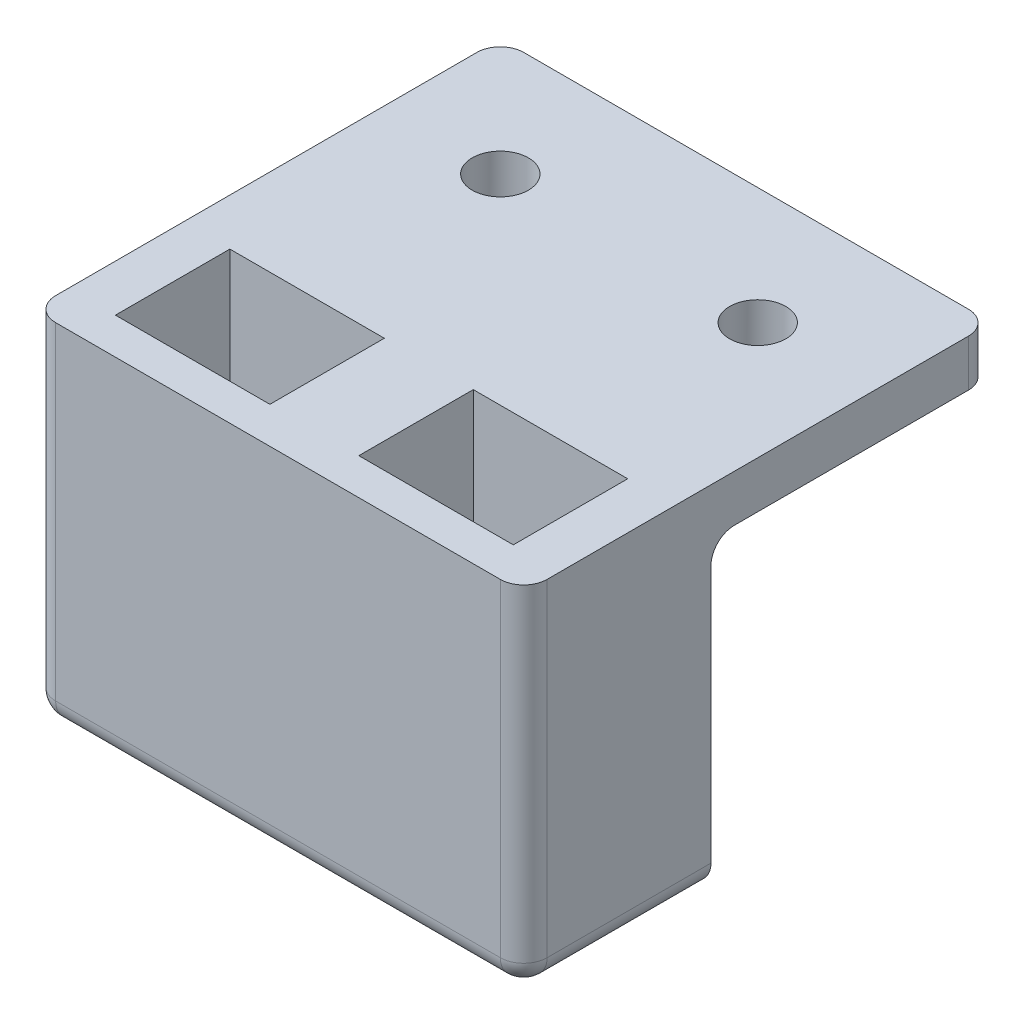
ISO-10303-21;
HEADER;
FILE_DESCRIPTION(('STEP AP214'),'2;1');
FILE_NAME('part.step','',(''),(''),'','','');
FILE_SCHEMA(('AUTOMOTIVE_DESIGN { 1 0 10303 214 1 1 1 1 }'));
ENDSEC;
DATA;
#1=APPLICATION_CONTEXT('core data for automotive mechanical design processes');
#2=APPLICATION_PROTOCOL_DEFINITION('international standard','automotive_design',2000,#1);
#3=PRODUCT_CONTEXT('',#1,'mechanical');
#4=PRODUCT('Part','Part','',(#3));
#5=PRODUCT_RELATED_PRODUCT_CATEGORY('part','',(#4));
#6=PRODUCT_DEFINITION_FORMATION('','',#4);
#7=PRODUCT_DEFINITION_CONTEXT('part definition',#1,'design');
#8=PRODUCT_DEFINITION('design','',#6,#7);
#9=PRODUCT_DEFINITION_SHAPE('','',#8);
#10=(LENGTH_UNIT() NAMED_UNIT(*) SI_UNIT(.MILLI.,.METRE.));
#11=(NAMED_UNIT(*) PLANE_ANGLE_UNIT() SI_UNIT($,.RADIAN.));
#12=(NAMED_UNIT(*) SI_UNIT($,.STERADIAN.) SOLID_ANGLE_UNIT());
#13=UNCERTAINTY_MEASURE_WITH_UNIT(LENGTH_MEASURE(1.E-05),#10,'distance_accuracy_value','');
#14=(GEOMETRIC_REPRESENTATION_CONTEXT(3) GLOBAL_UNCERTAINTY_ASSIGNED_CONTEXT((#13)) GLOBAL_UNIT_ASSIGNED_CONTEXT((#10,
#11,#12)) REPRESENTATION_CONTEXT('',''));
#15=CARTESIAN_POINT('',(0.,0.,0.));
#16=DIRECTION('',(0.,0.,1.));
#17=DIRECTION('',(1.,0.,0.));
#18=AXIS2_PLACEMENT_3D('',#15,#16,#17);
#19=CARTESIAN_POINT('',(0.,15.,0.));
#20=DIRECTION('',(0.,-1.,0.));
#21=DIRECTION('',(0.,0.,-1.));
#22=AXIS2_PLACEMENT_3D('',#19,#20,#21);
#23=PLANE('',#22);
#24=CARTESIAN_POINT('',(5.,15.,-15.));
#25=DIRECTION('',(0.,1.,0.));
#26=DIRECTION('',(0.,0.,1.));
#27=AXIS2_PLACEMENT_3D('',#24,#25,#26);
#28=CIRCLE('',#27,1.2);
#29=CARTESIAN_POINT('',(5.,15.,-13.8));
#30=VERTEX_POINT('',#29);
#31=EDGE_CURVE('E609',#30,#30,#28,.T.);
#32=ORIENTED_EDGE('',*,*,#31,.F.);
#33=EDGE_LOOP('',(#32));
#34=FACE_BOUND('',#33,.T.);
#35=DIRECTION('',(0.,0.,1.));
#36=VECTOR('',#35,1.);
#37=CARTESIAN_POINT('',(19.,15.,-1.555));
#38=LINE('',#37,#36);
#39=CARTESIAN_POINT('',(19.,15.,-6.445));
#40=VERTEX_POINT('',#39);
#41=CARTESIAN_POINT('',(19.,15.,-1.555));
#42=VERTEX_POINT('',#41);
#43=EDGE_CURVE('E274',#40,#42,#38,.T.);
#44=ORIENTED_EDGE('',*,*,#43,.T.);
#45=DIRECTION('',(-1.,0.,0.));
#46=VECTOR('',#45,1.);
#47=CARTESIAN_POINT('',(19.,15.,-1.555));
#48=LINE('',#47,#46);
#49=CARTESIAN_POINT('',(12.4,15.,-1.555));
#50=VERTEX_POINT('',#49);
#51=EDGE_CURVE('E261',#42,#50,#48,.T.);
#52=ORIENTED_EDGE('',*,*,#51,.T.);
#53=DIRECTION('',(0.,0.,-1.));
#54=VECTOR('',#53,1.);
#55=CARTESIAN_POINT('',(12.4,15.,-1.555));
#56=LINE('',#55,#54);
#57=CARTESIAN_POINT('',(12.4,15.,-6.445));
#58=VERTEX_POINT('',#57);
#59=EDGE_CURVE('E266',#50,#58,#56,.T.);
#60=ORIENTED_EDGE('',*,*,#59,.T.);
#61=DIRECTION('',(1.,0.,0.));
#62=VECTOR('',#61,1.);
#63=CARTESIAN_POINT('',(19.,15.,-6.445));
#64=LINE('',#63,#62);
#65=EDGE_CURVE('E270',#58,#40,#64,.T.);
#66=ORIENTED_EDGE('',*,*,#65,.T.);
#67=EDGE_LOOP('',(#44,#52,#60,#66));
#68=FACE_BOUND('',#67,.T.);
#69=DIRECTION('',(0.,0.,-1.));
#70=VECTOR('',#69,1.);
#71=CARTESIAN_POINT('',(8.6,15.,-1.555));
#72=LINE('',#71,#70);
#73=CARTESIAN_POINT('',(8.6,15.,-1.555));
#74=VERTEX_POINT('',#73);
#75=CARTESIAN_POINT('',(8.6,15.,-6.445));
#76=VERTEX_POINT('',#75);
#77=EDGE_CURVE('E352',#74,#76,#72,.T.);
#78=ORIENTED_EDGE('',*,*,#77,.F.);
#79=DIRECTION('',(1.,0.,0.));
#80=VECTOR('',#79,1.);
#81=CARTESIAN_POINT('',(2.,15.,-1.555));
#82=LINE('',#81,#80);
#83=CARTESIAN_POINT('',(2.,15.,-1.555));
#84=VERTEX_POINT('',#83);
#85=EDGE_CURVE('E338',#84,#74,#82,.T.);
#86=ORIENTED_EDGE('',*,*,#85,.F.);
#87=DIRECTION('',(0.,0.,1.));
#88=VECTOR('',#87,1.);
#89=CARTESIAN_POINT('',(2.,15.,-1.555));
#90=LINE('',#89,#88);
#91=CARTESIAN_POINT('',(2.,15.,-6.445));
#92=VERTEX_POINT('',#91);
#93=EDGE_CURVE('E333',#92,#84,#90,.T.);
#94=ORIENTED_EDGE('',*,*,#93,.F.);
#95=DIRECTION('',(-1.,0.,0.));
#96=VECTOR('',#95,1.);
#97=CARTESIAN_POINT('',(2.,15.,-6.445));
#98=LINE('',#97,#96);
#99=EDGE_CURVE('E349',#76,#92,#98,.T.);
#100=ORIENTED_EDGE('',*,*,#99,.F.);
#101=EDGE_LOOP('',(#78,#86,#94,#100));
#102=FACE_BOUND('',#101,.T.);
#103=DIRECTION('',(1.,0.,0.));
#104=VECTOR('',#103,1.);
#105=CARTESIAN_POINT('',(21.,15.,-20.));
#106=LINE('',#105,#104);
#107=CARTESIAN_POINT('',(1.00000000000001,15.,-20.));
#108=VERTEX_POINT('',#107);
#109=CARTESIAN_POINT('',(20.,15.,-20.));
#110=VERTEX_POINT('',#109);
#111=EDGE_CURVE('E427',#108,#110,#106,.T.);
#112=ORIENTED_EDGE('',*,*,#111,.F.);
#113=CARTESIAN_POINT('',(1.,15.,-19.));
#114=DIRECTION('',(0.,-1.,0.));
#115=DIRECTION('',(0.,0.,-1.));
#116=AXIS2_PLACEMENT_3D('',#113,#114,#115);
#117=CIRCLE('',#116,1.);
#118=CARTESIAN_POINT('',(0.,15.,-19.));
#119=VERTEX_POINT('',#118);
#120=EDGE_CURVE('E60',#108,#119,#117,.F.);
#121=ORIENTED_EDGE('',*,*,#120,.T.);
#122=DIRECTION('',(0.,0.,1.));
#123=VECTOR('',#122,1.);
#124=CARTESIAN_POINT('',(0.,15.,0.));
#125=LINE('',#124,#123);
#126=CARTESIAN_POINT('',(0.,15.,-1.));
#127=VERTEX_POINT('',#126);
#128=EDGE_CURVE('E696',#119,#127,#125,.T.);
#129=ORIENTED_EDGE('',*,*,#128,.T.);
#130=CARTESIAN_POINT('',(1.,15.,-1.));
#131=DIRECTION('',(0.,-1.,0.));
#132=DIRECTION('',(0.,0.,-1.));
#133=AXIS2_PLACEMENT_3D('',#130,#131,#132);
#134=CIRCLE('',#133,1.);
#135=CARTESIAN_POINT('',(1.,15.,0.));
#136=VERTEX_POINT('',#135);
#137=EDGE_CURVE('E449',#127,#136,#134,.F.);
#138=ORIENTED_EDGE('',*,*,#137,.T.);
#139=DIRECTION('',(1.,0.,0.));
#140=VECTOR('',#139,1.);
#141=CARTESIAN_POINT('',(0.,15.,0.));
#142=LINE('',#141,#140);
#143=CARTESIAN_POINT('',(20.,15.,0.));
#144=VERTEX_POINT('',#143);
#145=EDGE_CURVE('E698',#136,#144,#142,.T.);
#146=ORIENTED_EDGE('',*,*,#145,.T.);
#147=CARTESIAN_POINT('',(20.,15.,-1.));
#148=DIRECTION('',(0.,-1.,0.));
#149=DIRECTION('',(0.,0.,-1.));
#150=AXIS2_PLACEMENT_3D('',#147,#148,#149);
#151=CIRCLE('',#150,1.);
#152=CARTESIAN_POINT('',(21.,15.,-1.));
#153=VERTEX_POINT('',#152);
#154=EDGE_CURVE('E451',#144,#153,#151,.F.);
#155=ORIENTED_EDGE('',*,*,#154,.T.);
#156=DIRECTION('',(0.,0.,-1.));
#157=VECTOR('',#156,1.);
#158=CARTESIAN_POINT('',(21.,15.,0.));
#159=LINE('',#158,#157);
#160=CARTESIAN_POINT('',(21.,15.,-19.));
#161=VERTEX_POINT('',#160);
#162=EDGE_CURVE('E380',#153,#161,#159,.T.);
#163=ORIENTED_EDGE('',*,*,#162,.T.);
#164=CARTESIAN_POINT('',(20.,15.,-19.));
#165=DIRECTION('',(0.,-1.,0.));
#166=DIRECTION('',(0.,0.,-1.));
#167=AXIS2_PLACEMENT_3D('',#164,#165,#166);
#168=CIRCLE('',#167,1.);
#169=EDGE_CURVE('E389',#161,#110,#168,.F.);
#170=ORIENTED_EDGE('',*,*,#169,.T.);
#171=EDGE_LOOP('',(#112,#121,#129,#138,#146,#155,#163,#170));
#172=FACE_BOUND('',#171,.T.);
#173=CARTESIAN_POINT('',(16.,15.,-15.));
#174=DIRECTION('',(0.,1.,0.));
#175=DIRECTION('',(0.,0.,1.));
#176=AXIS2_PLACEMENT_3D('',#173,#174,#175);
#177=CIRCLE('',#176,1.2);
#178=CARTESIAN_POINT('',(16.,15.,-13.8));
#179=VERTEX_POINT('',#178);
#180=EDGE_CURVE('E603',#179,#179,#177,.T.);
#181=ORIENTED_EDGE('',*,*,#180,.F.);
#182=EDGE_LOOP('',(#181));
#183=FACE_BOUND('',#182,.T.);
#184=ADVANCED_FACE('F37',(#34,#68,#102,#172,#183),#23,.F.);
#185=CARTESIAN_POINT('',(0.,15.,-8.));
#186=DIRECTION('',(0.,0.,1.));
#187=DIRECTION('',(1.,0.,0.));
#188=AXIS2_PLACEMENT_3D('',#185,#186,#187);
#189=PLANE('',#188);
#190=DIRECTION('',(0.,-1.,0.));
#191=VECTOR('',#190,1.);
#192=CARTESIAN_POINT('',(0.,15.,-8.));
#193=LINE('',#192,#191);
#194=CARTESIAN_POINT('',(0.,12.,-8.));
#195=VERTEX_POINT('',#194);
#196=CARTESIAN_POINT('',(0.,1.,-8.));
#197=VERTEX_POINT('',#196);
#198=EDGE_CURVE('E376',#195,#197,#193,.T.);
#199=ORIENTED_EDGE('',*,*,#198,.F.);
#200=DIRECTION('',(-1.,0.,0.));
#201=VECTOR('',#200,1.);
#202=CARTESIAN_POINT('',(21.,12.,-8.));
#203=LINE('',#202,#201);
#204=CARTESIAN_POINT('',(21.,12.,-8.));
#205=VERTEX_POINT('',#204);
#206=EDGE_CURVE('E381',#195,#205,#203,.F.);
#207=ORIENTED_EDGE('',*,*,#206,.T.);
#208=DIRECTION('',(0.,-1.,0.));
#209=VECTOR('',#208,1.);
#210=CARTESIAN_POINT('',(21.,15.,-8.));
#211=LINE('',#210,#209);
#212=CARTESIAN_POINT('',(21.,1.,-8.));
#213=VERTEX_POINT('',#212);
#214=EDGE_CURVE('E372',#205,#213,#211,.T.);
#215=ORIENTED_EDGE('',*,*,#214,.T.);
#216=CARTESIAN_POINT('',(20.,1.,-8.));
#217=DIRECTION('',(0.,0.,1.));
#218=DIRECTION('',(1.,0.,0.));
#219=AXIS2_PLACEMENT_3D('',#216,#217,#218);
#220=CIRCLE('',#219,1.);
#221=CARTESIAN_POINT('',(20.,0.,-8.));
#222=VERTEX_POINT('',#221);
#223=EDGE_CURVE('E464',#213,#222,#220,.F.);
#224=ORIENTED_EDGE('',*,*,#223,.T.);
#225=DIRECTION('',(-1.,0.,0.));
#226=VECTOR('',#225,1.);
#227=CARTESIAN_POINT('',(0.,0.,-8.));
#228=LINE('',#227,#226);
#229=CARTESIAN_POINT('',(1.,0.,-8.));
#230=VERTEX_POINT('',#229);
#231=EDGE_CURVE('E678',#222,#230,#228,.T.);
#232=ORIENTED_EDGE('',*,*,#231,.T.);
#233=CARTESIAN_POINT('',(1.,1.,-8.));
#234=DIRECTION('',(0.,0.,1.));
#235=DIRECTION('',(1.,0.,0.));
#236=AXIS2_PLACEMENT_3D('',#233,#234,#235);
#237=CIRCLE('',#236,1.);
#238=EDGE_CURVE('E411',#230,#197,#237,.F.);
#239=ORIENTED_EDGE('',*,*,#238,.T.);
#240=EDGE_LOOP('',(#199,#207,#215,#224,#232,#239));
#241=FACE_BOUND('',#240,.T.);
#242=ADVANCED_FACE('F407',(#241),#189,.F.);
#243=CARTESIAN_POINT('',(0.,3.,0.));
#244=DIRECTION('',(0.,-1.,0.));
#245=DIRECTION('',(0.,0.,-1.));
#246=AXIS2_PLACEMENT_3D('',#243,#244,#245);
#247=PLANE('',#246);
#248=DIRECTION('',(1.,0.,0.));
#249=VECTOR('',#248,1.);
#250=CARTESIAN_POINT('',(19.,3.,-6.445));
#251=LINE('',#250,#249);
#252=CARTESIAN_POINT('',(18.,3.,-6.445));
#253=VERTEX_POINT('',#252);
#254=CARTESIAN_POINT('',(19.,3.,-6.445));
#255=VERTEX_POINT('',#254);
#256=EDGE_CURVE('E273',#253,#255,#251,.T.);
#257=ORIENTED_EDGE('',*,*,#256,.F.);
#258=DIRECTION('',(0.,0.,1.));
#259=VECTOR('',#258,1.);
#260=CARTESIAN_POINT('',(18.,3.,-6.445));
#261=LINE('',#260,#259);
#262=CARTESIAN_POINT('',(18.,3.,-1.555));
#263=VERTEX_POINT('',#262);
#264=EDGE_CURVE('E241',#253,#263,#261,.T.);
#265=ORIENTED_EDGE('',*,*,#264,.T.);
#266=DIRECTION('',(-1.,0.,0.));
#267=VECTOR('',#266,1.);
#268=CARTESIAN_POINT('',(19.,3.,-1.555));
#269=LINE('',#268,#267);
#270=CARTESIAN_POINT('',(19.,3.,-1.555));
#271=VERTEX_POINT('',#270);
#272=EDGE_CURVE('E236',#271,#263,#269,.T.);
#273=ORIENTED_EDGE('',*,*,#272,.F.);
#274=DIRECTION('',(0.,0.,1.));
#275=VECTOR('',#274,1.);
#276=CARTESIAN_POINT('',(19.,3.,-1.555));
#277=LINE('',#276,#275);
#278=EDGE_CURVE('E283',#255,#271,#277,.T.);
#279=ORIENTED_EDGE('',*,*,#278,.F.);
#280=EDGE_LOOP('',(#257,#265,#273,#279));
#281=FACE_BOUND('',#280,.T.);
#282=ADVANCED_FACE('F521',(#281),#247,.F.);
#283=CARTESIAN_POINT('',(0.,0.,0.));
#284=DIRECTION('',(0.,-1.,0.));
#285=DIRECTION('',(0.,0.,-1.));
#286=AXIS2_PLACEMENT_3D('',#283,#284,#285);
#287=PLANE('',#286);
#288=DIRECTION('',(1.,0.,0.));
#289=VECTOR('',#288,1.);
#290=CARTESIAN_POINT('',(0.,0.,-1.));
#291=LINE('',#290,#289);
#292=CARTESIAN_POINT('',(20.,0.,-1.));
#293=VERTEX_POINT('',#292);
#294=CARTESIAN_POINT('',(1.,0.,-1.));
#295=VERTEX_POINT('',#294);
#296=EDGE_CURVE('E470',#293,#295,#291,.F.);
#297=ORIENTED_EDGE('',*,*,#296,.T.);
#298=DIRECTION('',(0.,0.,1.));
#299=VECTOR('',#298,1.);
#300=CARTESIAN_POINT('',(1.,0.,-8.));
#301=LINE('',#300,#299);
#302=EDGE_CURVE('E466',#295,#230,#301,.F.);
#303=ORIENTED_EDGE('',*,*,#302,.T.);
#304=ORIENTED_EDGE('',*,*,#231,.F.);
#305=DIRECTION('',(0.,0.,-1.));
#306=VECTOR('',#305,1.);
#307=CARTESIAN_POINT('',(20.,0.,0.));
#308=LINE('',#307,#306);
#309=EDGE_CURVE('E468',#222,#293,#308,.F.);
#310=ORIENTED_EDGE('',*,*,#309,.T.);
#311=EDGE_LOOP('',(#297,#303,#304,#310));
#312=FACE_BOUND('',#311,.T.);
#313=DIRECTION('',(1.,0.,0.));
#314=VECTOR('',#313,1.);
#315=CARTESIAN_POINT('',(3.,0.,-1.555));
#316=LINE('',#315,#314);
#317=CARTESIAN_POINT('',(3.,0.,-1.555));
#318=VERTEX_POINT('',#317);
#319=CARTESIAN_POINT('',(7.6,0.,-1.555));
#320=VERTEX_POINT('',#319);
#321=EDGE_CURVE('E311',#318,#320,#316,.T.);
#322=ORIENTED_EDGE('',*,*,#321,.T.);
#323=DIRECTION('',(0.,0.,-1.));
#324=VECTOR('',#323,1.);
#325=CARTESIAN_POINT('',(7.6,0.,-6.445));
#326=LINE('',#325,#324);
#327=CARTESIAN_POINT('',(7.6,0.,-6.445));
#328=VERTEX_POINT('',#327);
#329=EDGE_CURVE('E317',#320,#328,#326,.T.);
#330=ORIENTED_EDGE('',*,*,#329,.T.);
#331=DIRECTION('',(-1.,0.,0.));
#332=VECTOR('',#331,1.);
#333=CARTESIAN_POINT('',(3.,0.,-6.445));
#334=LINE('',#333,#332);
#335=CARTESIAN_POINT('',(3.,0.,-6.445));
#336=VERTEX_POINT('',#335);
#337=EDGE_CURVE('E322',#328,#336,#334,.T.);
#338=ORIENTED_EDGE('',*,*,#337,.T.);
#339=DIRECTION('',(0.,0.,1.));
#340=VECTOR('',#339,1.);
#341=CARTESIAN_POINT('',(3.,0.,-6.445));
#342=LINE('',#341,#340);
#343=EDGE_CURVE('E327',#336,#318,#342,.T.);
#344=ORIENTED_EDGE('',*,*,#343,.T.);
#345=EDGE_LOOP('',(#322,#330,#338,#344));
#346=FACE_BOUND('',#345,.T.);
#347=DIRECTION('',(-1.,0.,0.));
#348=VECTOR('',#347,1.);
#349=CARTESIAN_POINT('',(18.,0.,-1.555));
#350=LINE('',#349,#348);
#351=CARTESIAN_POINT('',(18.,0.,-1.555));
#352=VERTEX_POINT('',#351);
#353=CARTESIAN_POINT('',(13.4,0.,-1.555));
#354=VERTEX_POINT('',#353);
#355=EDGE_CURVE('E233',#352,#354,#350,.T.);
#356=ORIENTED_EDGE('',*,*,#355,.F.);
#357=DIRECTION('',(0.,0.,1.));
#358=VECTOR('',#357,1.);
#359=CARTESIAN_POINT('',(18.,0.,-6.445));
#360=LINE('',#359,#358);
#361=CARTESIAN_POINT('',(18.,0.,-6.445));
#362=VERTEX_POINT('',#361);
#363=EDGE_CURVE('E244',#362,#352,#360,.T.);
#364=ORIENTED_EDGE('',*,*,#363,.F.);
#365=DIRECTION('',(1.,0.,0.));
#366=VECTOR('',#365,1.);
#367=CARTESIAN_POINT('',(18.,0.,-6.445));
#368=LINE('',#367,#366);
#369=CARTESIAN_POINT('',(13.4,0.,-6.445));
#370=VERTEX_POINT('',#369);
#371=EDGE_CURVE('E250',#370,#362,#368,.T.);
#372=ORIENTED_EDGE('',*,*,#371,.F.);
#373=DIRECTION('',(0.,0.,-1.));
#374=VECTOR('',#373,1.);
#375=CARTESIAN_POINT('',(13.4,0.,-6.445));
#376=LINE('',#375,#374);
#377=EDGE_CURVE('E253',#354,#370,#376,.T.);
#378=ORIENTED_EDGE('',*,*,#377,.F.);
#379=EDGE_LOOP('',(#356,#364,#372,#378));
#380=FACE_BOUND('',#379,.T.);
#381=ADVANCED_FACE('F252',(#312,#346,#380),#287,.T.);
#382=CARTESIAN_POINT('',(0.,3.,0.));
#383=DIRECTION('',(0.,-1.,0.));
#384=DIRECTION('',(0.,0.,-1.));
#385=AXIS2_PLACEMENT_3D('',#382,#383,#384);
#386=PLANE('',#385);
#387=DIRECTION('',(0.,0.,1.));
#388=VECTOR('',#387,1.);
#389=CARTESIAN_POINT('',(3.,3.,-6.445));
#390=LINE('',#389,#388);
#391=CARTESIAN_POINT('',(3.,3.,-6.445));
#392=VERTEX_POINT('',#391);
#393=CARTESIAN_POINT('',(3.,3.,-1.555));
#394=VERTEX_POINT('',#393);
#395=EDGE_CURVE('E280',#392,#394,#390,.T.);
#396=ORIENTED_EDGE('',*,*,#395,.F.);
#397=DIRECTION('',(-1.,0.,0.));
#398=VECTOR('',#397,1.);
#399=CARTESIAN_POINT('',(2.,3.,-6.445));
#400=LINE('',#399,#398);
#401=CARTESIAN_POINT('',(2.,3.,-6.445));
#402=VERTEX_POINT('',#401);
#403=EDGE_CURVE('E312',#392,#402,#400,.T.);
#404=ORIENTED_EDGE('',*,*,#403,.T.);
#405=DIRECTION('',(0.,0.,1.));
#406=VECTOR('',#405,1.);
#407=CARTESIAN_POINT('',(2.,3.,-1.555));
#408=LINE('',#407,#406);
#409=CARTESIAN_POINT('',(2.,3.,-1.555));
#410=VERTEX_POINT('',#409);
#411=EDGE_CURVE('E359',#402,#410,#408,.T.);
#412=ORIENTED_EDGE('',*,*,#411,.T.);
#413=DIRECTION('',(1.,0.,0.));
#414=VECTOR('',#413,1.);
#415=CARTESIAN_POINT('',(2.,3.,-1.555));
#416=LINE('',#415,#414);
#417=EDGE_CURVE('E363',#410,#394,#416,.T.);
#418=ORIENTED_EDGE('',*,*,#417,.T.);
#419=EDGE_LOOP('',(#396,#404,#412,#418));
#420=FACE_BOUND('',#419,.T.);
#421=ADVANCED_FACE('F528',(#420),#386,.F.);
#422=DIRECTION('',(0.,0.,-1.));
#423=VECTOR('',#422,1.);
#424=CARTESIAN_POINT('',(7.6,3.,-6.445));
#425=LINE('',#424,#423);
#426=CARTESIAN_POINT('',(7.6,3.,-1.555));
#427=VERTEX_POINT('',#426);
#428=CARTESIAN_POINT('',(7.6,3.,-6.445));
#429=VERTEX_POINT('',#428);
#430=EDGE_CURVE('E307',#427,#429,#425,.T.);
#431=ORIENTED_EDGE('',*,*,#430,.F.);
#432=CARTESIAN_POINT('',(8.6,3.,-1.555));
#433=VERTEX_POINT('',#432);
#434=EDGE_CURVE('E351',#427,#433,#416,.T.);
#435=ORIENTED_EDGE('',*,*,#434,.T.);
#436=DIRECTION('',(0.,0.,-1.));
#437=VECTOR('',#436,1.);
#438=CARTESIAN_POINT('',(8.6,3.,-1.555));
#439=LINE('',#438,#437);
#440=CARTESIAN_POINT('',(8.6,3.,-6.445));
#441=VERTEX_POINT('',#440);
#442=EDGE_CURVE('E689',#433,#441,#439,.T.);
#443=ORIENTED_EDGE('',*,*,#442,.T.);
#444=EDGE_CURVE('E727',#441,#429,#400,.T.);
#445=ORIENTED_EDGE('',*,*,#444,.T.);
#446=EDGE_LOOP('',(#431,#435,#443,#445));
#447=FACE_BOUND('',#446,.T.);
#448=ADVANCED_FACE('F553',(#447),#386,.F.);
#449=CARTESIAN_POINT('',(0.,15.,0.));
#450=DIRECTION('',(1.,0.,0.));
#451=DIRECTION('',(0.,0.,-1.));
#452=AXIS2_PLACEMENT_3D('',#449,#450,#451);
#453=PLANE('',#452);
#454=ORIENTED_EDGE('',*,*,#128,.F.);
#455=DIRECTION('',(0.,1.,0.));
#456=VECTOR('',#455,1.);
#457=CARTESIAN_POINT('',(0.,13.,-19.));
#458=LINE('',#457,#456);
#459=CARTESIAN_POINT('',(0.,13.,-19.));
#460=VERTEX_POINT('',#459);
#461=EDGE_CURVE('E392',#119,#460,#458,.F.);
#462=ORIENTED_EDGE('',*,*,#461,.T.);
#463=DIRECTION('',(0.,0.,1.));
#464=VECTOR('',#463,1.);
#465=CARTESIAN_POINT('',(0.,13.,-20.));
#466=LINE('',#465,#464);
#467=CARTESIAN_POINT('',(0.,13.,-9.));
#468=VERTEX_POINT('',#467);
#469=EDGE_CURVE('E401',#460,#468,#466,.T.);
#470=ORIENTED_EDGE('',*,*,#469,.T.);
#471=CARTESIAN_POINT('',(0.,12.,-9.));
#472=DIRECTION('',(1.,0.,0.));
#473=DIRECTION('',(0.,0.,-1.));
#474=AXIS2_PLACEMENT_3D('',#471,#472,#473);
#475=CIRCLE('',#474,1.);
#476=EDGE_CURVE('E45',#468,#195,#475,.T.);
#477=ORIENTED_EDGE('',*,*,#476,.T.);
#478=ORIENTED_EDGE('',*,*,#198,.T.);
#479=DIRECTION('',(0.,0.,1.));
#480=VECTOR('',#479,1.);
#481=CARTESIAN_POINT('',(0.,1.,0.));
#482=LINE('',#481,#480);
#483=CARTESIAN_POINT('',(0.,1.,-1.));
#484=VERTEX_POINT('',#483);
#485=EDGE_CURVE('E472',#197,#484,#482,.T.);
#486=ORIENTED_EDGE('',*,*,#485,.T.);
#487=DIRECTION('',(0.,-1.,0.));
#488=VECTOR('',#487,1.);
#489=CARTESIAN_POINT('',(0.,15.,-1.));
#490=LINE('',#489,#488);
#491=EDGE_CURVE('E375',#484,#127,#490,.F.);
#492=ORIENTED_EDGE('',*,*,#491,.T.);
#493=EDGE_LOOP('',(#454,#462,#470,#477,#478,#486,#492));
#494=FACE_BOUND('',#493,.T.);
#495=ADVANCED_FACE('F397',(#494),#453,.F.);
#496=CARTESIAN_POINT('',(0.,15.,0.));
#497=DIRECTION('',(0.,0.,-1.));
#498=DIRECTION('',(-1.,0.,0.));
#499=AXIS2_PLACEMENT_3D('',#496,#497,#498);
#500=PLANE('',#499);
#501=ORIENTED_EDGE('',*,*,#145,.F.);
#502=DIRECTION('',(0.,-1.,0.));
#503=VECTOR('',#502,1.);
#504=CARTESIAN_POINT('',(1.,15.,0.));
#505=LINE('',#504,#503);
#506=CARTESIAN_POINT('',(1.,1.,0.));
#507=VERTEX_POINT('',#506);
#508=EDGE_CURVE('E453',#136,#507,#505,.T.);
#509=ORIENTED_EDGE('',*,*,#508,.T.);
#510=DIRECTION('',(1.,0.,0.));
#511=VECTOR('',#510,1.);
#512=CARTESIAN_POINT('',(21.,1.,0.));
#513=LINE('',#512,#511);
#514=CARTESIAN_POINT('',(20.,1.,0.));
#515=VERTEX_POINT('',#514);
#516=EDGE_CURVE('E455',#507,#515,#513,.T.);
#517=ORIENTED_EDGE('',*,*,#516,.T.);
#518=DIRECTION('',(0.,-1.,0.));
#519=VECTOR('',#518,1.);
#520=CARTESIAN_POINT('',(20.,15.,0.));
#521=LINE('',#520,#519);
#522=EDGE_CURVE('E457',#515,#144,#521,.F.);
#523=ORIENTED_EDGE('',*,*,#522,.T.);
#524=EDGE_LOOP('',(#501,#509,#517,#523));
#525=FACE_BOUND('',#524,.T.);
#526=ADVANCED_FACE('F547',(#525),#500,.F.);
#527=CARTESIAN_POINT('',(21.,15.,0.));
#528=DIRECTION('',(-1.,0.,0.));
#529=DIRECTION('',(0.,0.,1.));
#530=AXIS2_PLACEMENT_3D('',#527,#528,#529);
#531=PLANE('',#530);
#532=DIRECTION('',(0.,0.,1.));
#533=VECTOR('',#532,1.);
#534=CARTESIAN_POINT('',(21.,13.,-20.));
#535=LINE('',#534,#533);
#536=CARTESIAN_POINT('',(21.,13.,-19.));
#537=VERTEX_POINT('',#536);
#538=CARTESIAN_POINT('',(21.,13.,-9.));
#539=VERTEX_POINT('',#538);
#540=EDGE_CURVE('E417',#537,#539,#535,.T.);
#541=ORIENTED_EDGE('',*,*,#540,.F.);
#542=DIRECTION('',(0.,-1.,0.));
#543=VECTOR('',#542,1.);
#544=CARTESIAN_POINT('',(21.,15.,-19.));
#545=LINE('',#544,#543);
#546=EDGE_CURVE('E52',#537,#161,#545,.F.);
#547=ORIENTED_EDGE('',*,*,#546,.T.);
#548=ORIENTED_EDGE('',*,*,#162,.F.);
#549=DIRECTION('',(0.,-1.,0.));
#550=VECTOR('',#549,1.);
#551=CARTESIAN_POINT('',(21.,15.,-1.));
#552=LINE('',#551,#550);
#553=CARTESIAN_POINT('',(21.,1.,-1.));
#554=VERTEX_POINT('',#553);
#555=EDGE_CURVE('E461',#153,#554,#552,.T.);
#556=ORIENTED_EDGE('',*,*,#555,.T.);
#557=DIRECTION('',(0.,0.,-1.));
#558=VECTOR('',#557,1.);
#559=CARTESIAN_POINT('',(21.,1.,-8.));
#560=LINE('',#559,#558);
#561=EDGE_CURVE('E459',#554,#213,#560,.T.);
#562=ORIENTED_EDGE('',*,*,#561,.T.);
#563=ORIENTED_EDGE('',*,*,#214,.F.);
#564=CARTESIAN_POINT('',(21.,12.,-9.));
#565=DIRECTION('',(-1.,0.,0.));
#566=DIRECTION('',(0.,0.,1.));
#567=AXIS2_PLACEMENT_3D('',#564,#565,#566);
#568=CIRCLE('',#567,1.);
#569=EDGE_CURVE('E12',#205,#539,#568,.T.);
#570=ORIENTED_EDGE('',*,*,#569,.T.);
#571=EDGE_LOOP('',(#541,#547,#548,#556,#562,#563,#570));
#572=FACE_BOUND('',#571,.T.);
#573=ADVANCED_FACE('F416',(#572),#531,.F.);
#574=CARTESIAN_POINT('',(2.,-8.21414024715916,-1.555));
#575=DIRECTION('',(0.,0.,1.));
#576=DIRECTION('',(1.,0.,0.));
#577=AXIS2_PLACEMENT_3D('',#574,#575,#576);
#578=PLANE('',#577);
#579=DIRECTION('',(0.,1.,0.));
#580=VECTOR('',#579,1.);
#581=CARTESIAN_POINT('',(2.,-8.21414024715916,-1.555));
#582=LINE('',#581,#580);
#583=EDGE_CURVE('E672',#410,#84,#582,.T.);
#584=ORIENTED_EDGE('',*,*,#583,.T.);
#585=ORIENTED_EDGE('',*,*,#85,.T.);
#586=DIRECTION('',(0.,1.,0.));
#587=VECTOR('',#586,1.);
#588=CARTESIAN_POINT('',(8.6,-8.21414024715916,-1.555));
#589=LINE('',#588,#587);
#590=EDGE_CURVE('E366',#433,#74,#589,.T.);
#591=ORIENTED_EDGE('',*,*,#590,.F.);
#592=ORIENTED_EDGE('',*,*,#434,.F.);
#593=DIRECTION('',(0.,1.,0.));
#594=VECTOR('',#593,1.);
#595=CARTESIAN_POINT('',(7.6,-6.71357579833579,-1.555));
#596=LINE('',#595,#594);
#597=EDGE_CURVE('E315',#320,#427,#596,.T.);
#598=ORIENTED_EDGE('',*,*,#597,.F.);
#599=ORIENTED_EDGE('',*,*,#321,.F.);
#600=DIRECTION('',(0.,1.,0.));
#601=VECTOR('',#600,1.);
#602=CARTESIAN_POINT('',(3.,-6.71357579833579,-1.555));
#603=LINE('',#602,#601);
#604=EDGE_CURVE('E332',#318,#394,#603,.T.);
#605=ORIENTED_EDGE('',*,*,#604,.T.);
#606=ORIENTED_EDGE('',*,*,#417,.F.);
#607=EDGE_LOOP('',(#584,#585,#591,#592,#598,#599,#605,#606));
#608=FACE_BOUND('',#607,.T.);
#609=ADVANCED_FACE('F546',(#608),#578,.F.);
#610=CARTESIAN_POINT('',(8.6,-8.21414024715916,-1.555));
#611=DIRECTION('',(1.,0.,0.));
#612=DIRECTION('',(0.,0.,-1.));
#613=AXIS2_PLACEMENT_3D('',#610,#611,#612);
#614=PLANE('',#613);
#615=ORIENTED_EDGE('',*,*,#590,.T.);
#616=ORIENTED_EDGE('',*,*,#77,.T.);
#617=DIRECTION('',(0.,1.,0.));
#618=VECTOR('',#617,1.);
#619=CARTESIAN_POINT('',(8.6,-8.21414024715916,-6.445));
#620=LINE('',#619,#618);
#621=EDGE_CURVE('E687',#441,#76,#620,.T.);
#622=ORIENTED_EDGE('',*,*,#621,.F.);
#623=ORIENTED_EDGE('',*,*,#442,.F.);
#624=EDGE_LOOP('',(#615,#616,#622,#623));
#625=FACE_BOUND('',#624,.T.);
#626=ADVANCED_FACE('F664',(#625),#614,.F.);
#627=CARTESIAN_POINT('',(2.,-8.21414024715916,-6.445));
#628=DIRECTION('',(0.,0.,-1.));
#629=DIRECTION('',(-1.,0.,0.));
#630=AXIS2_PLACEMENT_3D('',#627,#628,#629);
#631=PLANE('',#630);
#632=ORIENTED_EDGE('',*,*,#621,.T.);
#633=ORIENTED_EDGE('',*,*,#99,.T.);
#634=DIRECTION('',(0.,1.,0.));
#635=VECTOR('',#634,1.);
#636=CARTESIAN_POINT('',(2.,-8.21414024715916,-6.445));
#637=LINE('',#636,#635);
#638=EDGE_CURVE('E683',#402,#92,#637,.T.);
#639=ORIENTED_EDGE('',*,*,#638,.F.);
#640=ORIENTED_EDGE('',*,*,#403,.F.);
#641=DIRECTION('',(0.,1.,0.));
#642=VECTOR('',#641,1.);
#643=CARTESIAN_POINT('',(3.,-6.71357579833579,-6.445));
#644=LINE('',#643,#642);
#645=EDGE_CURVE('E325',#336,#392,#644,.T.);
#646=ORIENTED_EDGE('',*,*,#645,.F.);
#647=ORIENTED_EDGE('',*,*,#337,.F.);
#648=DIRECTION('',(0.,1.,0.));
#649=VECTOR('',#648,1.);
#650=CARTESIAN_POINT('',(7.6,-6.71357579833579,-6.445));
#651=LINE('',#650,#649);
#652=EDGE_CURVE('E320',#328,#429,#651,.T.);
#653=ORIENTED_EDGE('',*,*,#652,.T.);
#654=ORIENTED_EDGE('',*,*,#444,.F.);
#655=EDGE_LOOP('',(#632,#633,#639,#640,#646,#647,#653,#654));
#656=FACE_BOUND('',#655,.T.);
#657=ADVANCED_FACE('F660',(#656),#631,.F.);
#658=CARTESIAN_POINT('',(2.,-8.21414024715916,-1.555));
#659=DIRECTION('',(-1.,0.,0.));
#660=DIRECTION('',(0.,0.,1.));
#661=AXIS2_PLACEMENT_3D('',#658,#659,#660);
#662=PLANE('',#661);
#663=ORIENTED_EDGE('',*,*,#638,.T.);
#664=ORIENTED_EDGE('',*,*,#93,.T.);
#665=ORIENTED_EDGE('',*,*,#583,.F.);
#666=ORIENTED_EDGE('',*,*,#411,.F.);
#667=EDGE_LOOP('',(#663,#664,#665,#666));
#668=FACE_BOUND('',#667,.T.);
#669=ADVANCED_FACE('F654',(#668),#662,.F.);
#670=CARTESIAN_POINT('',(7.6,-6.71357579833579,-6.445));
#671=DIRECTION('',(1.,0.,0.));
#672=DIRECTION('',(0.,0.,-1.));
#673=AXIS2_PLACEMENT_3D('',#670,#671,#672);
#674=PLANE('',#673);
#675=ORIENTED_EDGE('',*,*,#597,.T.);
#676=ORIENTED_EDGE('',*,*,#430,.T.);
#677=ORIENTED_EDGE('',*,*,#652,.F.);
#678=ORIENTED_EDGE('',*,*,#329,.F.);
#679=EDGE_LOOP('',(#675,#676,#677,#678));
#680=FACE_BOUND('',#679,.T.);
#681=ADVANCED_FACE('F649',(#680),#674,.F.);
#682=CARTESIAN_POINT('',(3.,-6.71357579833579,-6.445));
#683=DIRECTION('',(-1.,0.,0.));
#684=DIRECTION('',(0.,0.,1.));
#685=AXIS2_PLACEMENT_3D('',#682,#683,#684);
#686=PLANE('',#685);
#687=ORIENTED_EDGE('',*,*,#645,.T.);
#688=ORIENTED_EDGE('',*,*,#395,.T.);
#689=ORIENTED_EDGE('',*,*,#604,.F.);
#690=ORIENTED_EDGE('',*,*,#343,.F.);
#691=EDGE_LOOP('',(#687,#688,#689,#690));
#692=FACE_BOUND('',#691,.T.);
#693=ADVANCED_FACE('F645',(#692),#686,.F.);
#694=CARTESIAN_POINT('',(19.,-8.21414024715916,-1.555));
#695=DIRECTION('',(-1.,0.,0.));
#696=DIRECTION('',(0.,0.,1.));
#697=AXIS2_PLACEMENT_3D('',#694,#695,#696);
#698=PLANE('',#697);
#699=ORIENTED_EDGE('',*,*,#278,.T.);
#700=DIRECTION('',(0.,1.,0.));
#701=VECTOR('',#700,1.);
#702=CARTESIAN_POINT('',(19.,-8.21414024715916,-1.555));
#703=LINE('',#702,#701);
#704=EDGE_CURVE('E265',#271,#42,#703,.T.);
#705=ORIENTED_EDGE('',*,*,#704,.T.);
#706=ORIENTED_EDGE('',*,*,#43,.F.);
#707=DIRECTION('',(0.,1.,0.));
#708=VECTOR('',#707,1.);
#709=CARTESIAN_POINT('',(19.,-8.21414024715916,-6.445));
#710=LINE('',#709,#708);
#711=EDGE_CURVE('E255',#255,#40,#710,.T.);
#712=ORIENTED_EDGE('',*,*,#711,.F.);
#713=EDGE_LOOP('',(#699,#705,#706,#712));
#714=FACE_BOUND('',#713,.T.);
#715=ADVANCED_FACE('F518',(#714),#698,.T.);
#716=CARTESIAN_POINT('',(19.,-8.21414024715916,-1.555));
#717=DIRECTION('',(0.,0.,-1.));
#718=DIRECTION('',(-1.,0.,0.));
#719=AXIS2_PLACEMENT_3D('',#716,#717,#718);
#720=PLANE('',#719);
#721=ORIENTED_EDGE('',*,*,#272,.T.);
#722=DIRECTION('',(0.,1.,0.));
#723=VECTOR('',#722,1.);
#724=CARTESIAN_POINT('',(18.,-6.71357579833578,-1.555));
#725=LINE('',#724,#723);
#726=EDGE_CURVE('E229',#352,#263,#725,.T.);
#727=ORIENTED_EDGE('',*,*,#726,.F.);
#728=ORIENTED_EDGE('',*,*,#355,.T.);
#729=DIRECTION('',(0.,1.,0.));
#730=VECTOR('',#729,1.);
#731=CARTESIAN_POINT('',(13.4,-6.71357579833578,-1.555));
#732=LINE('',#731,#730);
#733=CARTESIAN_POINT('',(13.4,3.,-1.555));
#734=VERTEX_POINT('',#733);
#735=EDGE_CURVE('E240',#354,#734,#732,.T.);
#736=ORIENTED_EDGE('',*,*,#735,.T.);
#737=CARTESIAN_POINT('',(12.4,3.,-1.555));
#738=VERTEX_POINT('',#737);
#739=EDGE_CURVE('E287',#734,#738,#269,.T.);
#740=ORIENTED_EDGE('',*,*,#739,.T.);
#741=DIRECTION('',(0.,1.,0.));
#742=VECTOR('',#741,1.);
#743=CARTESIAN_POINT('',(12.4,-8.21414024715916,-1.555));
#744=LINE('',#743,#742);
#745=EDGE_CURVE('E264',#738,#50,#744,.T.);
#746=ORIENTED_EDGE('',*,*,#745,.T.);
#747=ORIENTED_EDGE('',*,*,#51,.F.);
#748=ORIENTED_EDGE('',*,*,#704,.F.);
#749=EDGE_LOOP('',(#721,#727,#728,#736,#740,#746,#747,#748));
#750=FACE_BOUND('',#749,.T.);
#751=ADVANCED_FACE('F231',(#750),#720,.T.);
#752=CARTESIAN_POINT('',(12.4,-8.21414024715916,-1.555));
#753=DIRECTION('',(1.,0.,0.));
#754=DIRECTION('',(0.,0.,-1.));
#755=AXIS2_PLACEMENT_3D('',#752,#753,#754);
#756=PLANE('',#755);
#757=DIRECTION('',(0.,0.,-1.));
#758=VECTOR('',#757,1.);
#759=CARTESIAN_POINT('',(12.4,3.,-1.555));
#760=LINE('',#759,#758);
#761=CARTESIAN_POINT('',(12.4,3.,-6.445));
#762=VERTEX_POINT('',#761);
#763=EDGE_CURVE('E277',#738,#762,#760,.T.);
#764=ORIENTED_EDGE('',*,*,#763,.T.);
#765=DIRECTION('',(0.,1.,0.));
#766=VECTOR('',#765,1.);
#767=CARTESIAN_POINT('',(12.4,-8.21414024715916,-6.445));
#768=LINE('',#767,#766);
#769=EDGE_CURVE('E269',#762,#58,#768,.T.);
#770=ORIENTED_EDGE('',*,*,#769,.T.);
#771=ORIENTED_EDGE('',*,*,#59,.F.);
#772=ORIENTED_EDGE('',*,*,#745,.F.);
#773=EDGE_LOOP('',(#764,#770,#771,#772));
#774=FACE_BOUND('',#773,.T.);
#775=ADVANCED_FACE('F513',(#774),#756,.T.);
#776=CARTESIAN_POINT('',(19.,-8.21414024715916,-6.445));
#777=DIRECTION('',(0.,0.,1.));
#778=DIRECTION('',(1.,0.,0.));
#779=AXIS2_PLACEMENT_3D('',#776,#777,#778);
#780=PLANE('',#779);
#781=CARTESIAN_POINT('',(13.4,3.,-6.445));
#782=VERTEX_POINT('',#781);
#783=EDGE_CURVE('E292',#762,#782,#251,.T.);
#784=ORIENTED_EDGE('',*,*,#783,.T.);
#785=DIRECTION('',(0.,1.,0.));
#786=VECTOR('',#785,1.);
#787=CARTESIAN_POINT('',(13.4,-6.71357579833578,-6.445));
#788=LINE('',#787,#786);
#789=EDGE_CURVE('E260',#370,#782,#788,.T.);
#790=ORIENTED_EDGE('',*,*,#789,.F.);
#791=ORIENTED_EDGE('',*,*,#371,.T.);
#792=DIRECTION('',(0.,1.,0.));
#793=VECTOR('',#792,1.);
#794=CARTESIAN_POINT('',(18.,-6.71357579833578,-6.445));
#795=LINE('',#794,#793);
#796=EDGE_CURVE('E246',#362,#253,#795,.T.);
#797=ORIENTED_EDGE('',*,*,#796,.T.);
#798=ORIENTED_EDGE('',*,*,#256,.T.);
#799=ORIENTED_EDGE('',*,*,#711,.T.);
#800=ORIENTED_EDGE('',*,*,#65,.F.);
#801=ORIENTED_EDGE('',*,*,#769,.F.);
#802=EDGE_LOOP('',(#784,#790,#791,#797,#798,#799,#800,#801));
#803=FACE_BOUND('',#802,.T.);
#804=ADVANCED_FACE('F510',(#803),#780,.T.);
#805=ORIENTED_EDGE('',*,*,#739,.F.);
#806=DIRECTION('',(0.,0.,-1.));
#807=VECTOR('',#806,1.);
#808=CARTESIAN_POINT('',(13.4,3.,-6.445));
#809=LINE('',#808,#807);
#810=EDGE_CURVE('E486',#734,#782,#809,.T.);
#811=ORIENTED_EDGE('',*,*,#810,.T.);
#812=ORIENTED_EDGE('',*,*,#783,.F.);
#813=ORIENTED_EDGE('',*,*,#763,.F.);
#814=EDGE_LOOP('',(#805,#811,#812,#813));
#815=FACE_BOUND('',#814,.T.);
#816=ADVANCED_FACE('F503',(#815),#247,.F.);
#817=CARTESIAN_POINT('',(18.,-6.71357579833578,-6.445));
#818=DIRECTION('',(-1.,0.,0.));
#819=DIRECTION('',(0.,0.,1.));
#820=AXIS2_PLACEMENT_3D('',#817,#818,#819);
#821=PLANE('',#820);
#822=ORIENTED_EDGE('',*,*,#363,.T.);
#823=ORIENTED_EDGE('',*,*,#726,.T.);
#824=ORIENTED_EDGE('',*,*,#264,.F.);
#825=ORIENTED_EDGE('',*,*,#796,.F.);
#826=EDGE_LOOP('',(#822,#823,#824,#825));
#827=FACE_BOUND('',#826,.T.);
#828=ADVANCED_FACE('F245',(#827),#821,.T.);
#829=CARTESIAN_POINT('',(13.4,-6.71357579833578,-6.445));
#830=DIRECTION('',(1.,0.,0.));
#831=DIRECTION('',(0.,0.,-1.));
#832=AXIS2_PLACEMENT_3D('',#829,#830,#831);
#833=PLANE('',#832);
#834=ORIENTED_EDGE('',*,*,#377,.T.);
#835=ORIENTED_EDGE('',*,*,#789,.T.);
#836=ORIENTED_EDGE('',*,*,#810,.F.);
#837=ORIENTED_EDGE('',*,*,#735,.F.);
#838=EDGE_LOOP('',(#834,#835,#836,#837));
#839=FACE_BOUND('',#838,.T.);
#840=ADVANCED_FACE('F498',(#839),#833,.T.);
#841=CARTESIAN_POINT('',(20.,15.,-1.));
#842=DIRECTION('',(0.,-1.,0.));
#843=DIRECTION('',(0.,0.,-1.));
#844=AXIS2_PLACEMENT_3D('',#841,#842,#843);
#845=CYLINDRICAL_SURFACE('',#844,1.);
#846=ORIENTED_EDGE('',*,*,#154,.F.);
#847=ORIENTED_EDGE('',*,*,#522,.F.);
#848=CARTESIAN_POINT('',(20.,1.,-1.));
#849=DIRECTION('',(0.,-1.,0.));
#850=DIRECTION('',(0.,0.,-1.));
#851=AXIS2_PLACEMENT_3D('',#848,#849,#850);
#852=CIRCLE('',#851,1.);
#853=EDGE_CURVE('E435',#554,#515,#852,.T.);
#854=ORIENTED_EDGE('',*,*,#853,.F.);
#855=ORIENTED_EDGE('',*,*,#555,.F.);
#856=EDGE_LOOP('',(#846,#847,#854,#855));
#857=FACE_BOUND('',#856,.T.);
#858=ADVANCED_FACE('F577',(#857),#845,.T.);
#859=CARTESIAN_POINT('',(20.,1.,0.));
#860=DIRECTION('',(0.,0.,1.));
#861=DIRECTION('',(1.,0.,0.));
#862=AXIS2_PLACEMENT_3D('',#859,#860,#861);
#863=CYLINDRICAL_SURFACE('',#862,1.);
#864=ORIENTED_EDGE('',*,*,#223,.F.);
#865=ORIENTED_EDGE('',*,*,#561,.F.);
#866=CARTESIAN_POINT('',(20.,1.,-1.));
#867=DIRECTION('',(0.,0.,1.));
#868=DIRECTION('',(1.,0.,0.));
#869=AXIS2_PLACEMENT_3D('',#866,#867,#868);
#870=CIRCLE('',#869,1.);
#871=EDGE_CURVE('E438',#293,#554,#870,.T.);
#872=ORIENTED_EDGE('',*,*,#871,.F.);
#873=ORIENTED_EDGE('',*,*,#309,.F.);
#874=EDGE_LOOP('',(#864,#865,#872,#873));
#875=FACE_BOUND('',#874,.T.);
#876=ADVANCED_FACE('F573',(#875),#863,.T.);
#877=CARTESIAN_POINT('',(20.,1.,-1.));
#878=DIRECTION('',(0.,0.,1.));
#879=DIRECTION('',(1.,0.,0.));
#880=AXIS2_PLACEMENT_3D('',#877,#878,#879);
#881=SPHERICAL_SURFACE('',#880,1.);
#882=ORIENTED_EDGE('',*,*,#871,.T.);
#883=ORIENTED_EDGE('',*,*,#853,.T.);
#884=CARTESIAN_POINT('',(20.,1.,-1.));
#885=DIRECTION('',(1.,0.,0.));
#886=DIRECTION('',(0.,0.,-1.));
#887=AXIS2_PLACEMENT_3D('',#884,#885,#886);
#888=CIRCLE('',#887,1.);
#889=EDGE_CURVE('E441',#293,#515,#888,.F.);
#890=ORIENTED_EDGE('',*,*,#889,.F.);
#891=EDGE_LOOP('',(#882,#883,#890));
#892=FACE_BOUND('',#891,.T.);
#893=ADVANCED_FACE('F569',(#892),#881,.T.);
#894=CARTESIAN_POINT('',(1.,15.,-1.));
#895=DIRECTION('',(0.,-1.,0.));
#896=DIRECTION('',(0.,0.,-1.));
#897=AXIS2_PLACEMENT_3D('',#894,#895,#896);
#898=CYLINDRICAL_SURFACE('',#897,1.);
#899=ORIENTED_EDGE('',*,*,#137,.F.);
#900=ORIENTED_EDGE('',*,*,#491,.F.);
#901=CARTESIAN_POINT('',(1.,1.,-1.));
#902=DIRECTION('',(0.,-1.,0.));
#903=DIRECTION('',(0.,0.,-1.));
#904=AXIS2_PLACEMENT_3D('',#901,#902,#903);
#905=CIRCLE('',#904,1.);
#906=EDGE_CURVE('E444',#507,#484,#905,.T.);
#907=ORIENTED_EDGE('',*,*,#906,.F.);
#908=ORIENTED_EDGE('',*,*,#508,.F.);
#909=EDGE_LOOP('',(#899,#900,#907,#908));
#910=FACE_BOUND('',#909,.T.);
#911=ADVANCED_FACE('F565',(#910),#898,.T.);
#912=CARTESIAN_POINT('',(0.,1.,-1.));
#913=DIRECTION('',(-1.,0.,0.));
#914=DIRECTION('',(0.,0.,1.));
#915=AXIS2_PLACEMENT_3D('',#912,#913,#914);
#916=CYLINDRICAL_SURFACE('',#915,1.);
#917=ORIENTED_EDGE('',*,*,#889,.T.);
#918=ORIENTED_EDGE('',*,*,#516,.F.);
#919=CARTESIAN_POINT('',(1.,1.,-1.));
#920=DIRECTION('',(-1.,0.,0.));
#921=DIRECTION('',(0.,0.,1.));
#922=AXIS2_PLACEMENT_3D('',#919,#920,#921);
#923=CIRCLE('',#922,1.);
#924=EDGE_CURVE('E425',#295,#507,#923,.T.);
#925=ORIENTED_EDGE('',*,*,#924,.F.);
#926=ORIENTED_EDGE('',*,*,#296,.F.);
#927=EDGE_LOOP('',(#917,#918,#925,#926));
#928=FACE_BOUND('',#927,.T.);
#929=ADVANCED_FACE('F561',(#928),#916,.T.);
#930=CARTESIAN_POINT('',(1.,1.,-1.));
#931=DIRECTION('',(0.,0.,1.));
#932=DIRECTION('',(1.,0.,0.));
#933=AXIS2_PLACEMENT_3D('',#930,#931,#932);
#934=SPHERICAL_SURFACE('',#933,1.);
#935=ORIENTED_EDGE('',*,*,#924,.T.);
#936=ORIENTED_EDGE('',*,*,#906,.T.);
#937=CARTESIAN_POINT('',(1.,1.,-1.));
#938=DIRECTION('',(0.,0.,1.));
#939=DIRECTION('',(1.,0.,0.));
#940=AXIS2_PLACEMENT_3D('',#937,#938,#939);
#941=CIRCLE('',#940,1.);
#942=EDGE_CURVE('E423',#295,#484,#941,.F.);
#943=ORIENTED_EDGE('',*,*,#942,.F.);
#944=EDGE_LOOP('',(#935,#936,#943));
#945=FACE_BOUND('',#944,.T.);
#946=ADVANCED_FACE('F557',(#945),#934,.T.);
#947=CARTESIAN_POINT('',(1.,1.,0.));
#948=DIRECTION('',(0.,0.,-1.));
#949=DIRECTION('',(-1.,0.,0.));
#950=AXIS2_PLACEMENT_3D('',#947,#948,#949);
#951=CYLINDRICAL_SURFACE('',#950,1.);
#952=ORIENTED_EDGE('',*,*,#238,.F.);
#953=ORIENTED_EDGE('',*,*,#302,.F.);
#954=ORIENTED_EDGE('',*,*,#942,.T.);
#955=ORIENTED_EDGE('',*,*,#485,.F.);
#956=EDGE_LOOP('',(#952,#953,#954,#955));
#957=FACE_BOUND('',#956,.T.);
#958=ADVANCED_FACE('F554',(#957),#951,.T.);
#959=CARTESIAN_POINT('',(21.,13.,-20.));
#960=DIRECTION('',(0.,1.,0.));
#961=DIRECTION('',(-1.,0.,0.));
#962=AXIS2_PLACEMENT_3D('',#959,#960,#961);
#963=PLANE('',#962);
#964=CARTESIAN_POINT('',(5.,13.,-15.));
#965=DIRECTION('',(0.,1.,0.));
#966=DIRECTION('',(-1.,0.,0.));
#967=AXIS2_PLACEMENT_3D('',#964,#965,#966);
#968=CIRCLE('',#967,1.2);
#969=CARTESIAN_POINT('',(3.8,13.,-15.));
#970=VERTEX_POINT('',#969);
#971=EDGE_CURVE('E607',#970,#970,#968,.F.);
#972=ORIENTED_EDGE('',*,*,#971,.F.);
#973=EDGE_LOOP('',(#972));
#974=FACE_BOUND('',#973,.T.);
#975=CARTESIAN_POINT('',(16.,13.,-15.));
#976=DIRECTION('',(0.,1.,0.));
#977=DIRECTION('',(-1.,0.,0.));
#978=AXIS2_PLACEMENT_3D('',#975,#976,#977);
#979=CIRCLE('',#978,1.2);
#980=CARTESIAN_POINT('',(14.8,13.,-15.));
#981=VERTEX_POINT('',#980);
#982=EDGE_CURVE('E601',#981,#981,#979,.F.);
#983=ORIENTED_EDGE('',*,*,#982,.F.);
#984=EDGE_LOOP('',(#983));
#985=FACE_BOUND('',#984,.T.);
#986=ORIENTED_EDGE('',*,*,#540,.T.);
#987=DIRECTION('',(-1.,0.,0.));
#988=VECTOR('',#987,1.);
#989=CARTESIAN_POINT('',(0.,13.,-9.));
#990=LINE('',#989,#988);
#991=EDGE_CURVE('E377',#539,#468,#990,.T.);
#992=ORIENTED_EDGE('',*,*,#991,.T.);
#993=ORIENTED_EDGE('',*,*,#469,.F.);
#994=CARTESIAN_POINT('',(1.,13.,-19.));
#995=DIRECTION('',(0.,1.,0.));
#996=DIRECTION('',(-1.,0.,0.));
#997=AXIS2_PLACEMENT_3D('',#994,#995,#996);
#998=CIRCLE('',#997,1.);
#999=CARTESIAN_POINT('',(1.00000000000001,13.,-20.));
#1000=VERTEX_POINT('',#999);
#1001=EDGE_CURVE('E595',#460,#1000,#998,.F.);
#1002=ORIENTED_EDGE('',*,*,#1001,.T.);
#1003=DIRECTION('',(-1.,0.,0.));
#1004=VECTOR('',#1003,1.);
#1005=CARTESIAN_POINT('',(21.,13.,-20.));
#1006=LINE('',#1005,#1004);
#1007=CARTESIAN_POINT('',(20.,13.,-20.));
#1008=VERTEX_POINT('',#1007);
#1009=EDGE_CURVE('E597',#1008,#1000,#1006,.T.);
#1010=ORIENTED_EDGE('',*,*,#1009,.F.);
#1011=CARTESIAN_POINT('',(20.,13.,-19.));
#1012=DIRECTION('',(0.,1.,0.));
#1013=DIRECTION('',(-1.,0.,0.));
#1014=AXIS2_PLACEMENT_3D('',#1011,#1012,#1013);
#1015=CIRCLE('',#1014,1.);
#1016=EDGE_CURVE('E422',#1008,#537,#1015,.F.);
#1017=ORIENTED_EDGE('',*,*,#1016,.T.);
#1018=EDGE_LOOP('',(#986,#992,#993,#1002,#1010,#1017));
#1019=FACE_BOUND('',#1018,.T.);
#1020=ADVANCED_FACE('F420',(#974,#985,#1019),#963,.F.);
#1021=CARTESIAN_POINT('',(0.,0.,-20.));
#1022=DIRECTION('',(0.,0.,-1.));
#1023=DIRECTION('',(-1.,0.,0.));
#1024=AXIS2_PLACEMENT_3D('',#1021,#1022,#1023);
#1025=PLANE('',#1024);
#1026=ORIENTED_EDGE('',*,*,#1009,.T.);
#1027=DIRECTION('',(0.,1.,0.));
#1028=VECTOR('',#1027,1.);
#1029=CARTESIAN_POINT('',(1.,15.,-20.));
#1030=LINE('',#1029,#1028);
#1031=EDGE_CURVE('E386',#1000,#108,#1030,.T.);
#1032=ORIENTED_EDGE('',*,*,#1031,.T.);
#1033=ORIENTED_EDGE('',*,*,#111,.T.);
#1034=DIRECTION('',(0.,-1.,0.));
#1035=VECTOR('',#1034,1.);
#1036=CARTESIAN_POINT('',(20.,13.,-20.));
#1037=LINE('',#1036,#1035);
#1038=EDGE_CURVE('E383',#110,#1008,#1037,.T.);
#1039=ORIENTED_EDGE('',*,*,#1038,.T.);
#1040=EDGE_LOOP('',(#1026,#1032,#1033,#1039));
#1041=FACE_BOUND('',#1040,.T.);
#1042=ADVANCED_FACE('F584',(#1041),#1025,.T.);
#1043=CARTESIAN_POINT('',(21.,12.,-9.));
#1044=DIRECTION('',(1.,0.,0.));
#1045=DIRECTION('',(0.,1.,0.));
#1046=AXIS2_PLACEMENT_3D('',#1043,#1044,#1045);
#1047=CYLINDRICAL_SURFACE('',#1046,1.);
#1048=ORIENTED_EDGE('',*,*,#569,.F.);
#1049=ORIENTED_EDGE('',*,*,#206,.F.);
#1050=ORIENTED_EDGE('',*,*,#476,.F.);
#1051=ORIENTED_EDGE('',*,*,#991,.F.);
#1052=EDGE_LOOP('',(#1048,#1049,#1050,#1051));
#1053=FACE_BOUND('',#1052,.T.);
#1054=ADVANCED_FACE('F414',(#1053),#1047,.F.);
#1055=CARTESIAN_POINT('',(1.,0.,-19.));
#1056=DIRECTION('',(0.,-1.,0.));
#1057=DIRECTION('',(0.,0.,-1.));
#1058=AXIS2_PLACEMENT_3D('',#1055,#1056,#1057);
#1059=CYLINDRICAL_SURFACE('',#1058,1.);
#1060=ORIENTED_EDGE('',*,*,#1001,.F.);
#1061=ORIENTED_EDGE('',*,*,#461,.F.);
#1062=ORIENTED_EDGE('',*,*,#120,.F.);
#1063=ORIENTED_EDGE('',*,*,#1031,.F.);
#1064=EDGE_LOOP('',(#1060,#1061,#1062,#1063));
#1065=FACE_BOUND('',#1064,.T.);
#1066=ADVANCED_FACE('F583',(#1065),#1059,.T.);
#1067=CARTESIAN_POINT('',(20.,0.,-19.));
#1068=DIRECTION('',(0.,1.,0.));
#1069=DIRECTION('',(0.,0.,1.));
#1070=AXIS2_PLACEMENT_3D('',#1067,#1068,#1069);
#1071=CYLINDRICAL_SURFACE('',#1070,1.);
#1072=ORIENTED_EDGE('',*,*,#169,.F.);
#1073=ORIENTED_EDGE('',*,*,#546,.F.);
#1074=ORIENTED_EDGE('',*,*,#1016,.F.);
#1075=ORIENTED_EDGE('',*,*,#1038,.F.);
#1076=EDGE_LOOP('',(#1072,#1073,#1074,#1075));
#1077=FACE_BOUND('',#1076,.T.);
#1078=ADVANCED_FACE('F39',(#1077),#1071,.T.);
#1079=CARTESIAN_POINT('',(16.,15.,-15.));
#1080=DIRECTION('',(0.,1.,0.));
#1081=DIRECTION('',(0.,0.,1.));
#1082=AXIS2_PLACEMENT_3D('',#1079,#1080,#1081);
#1083=CYLINDRICAL_SURFACE('',#1082,1.2);
#1084=ORIENTED_EDGE('',*,*,#982,.T.);
#1085=EDGE_LOOP('',(#1084));
#1086=FACE_BOUND('',#1085,.T.);
#1087=ORIENTED_EDGE('',*,*,#180,.T.);
#1088=EDGE_LOOP('',(#1087));
#1089=FACE_BOUND('',#1088,.T.);
#1090=ADVANCED_FACE('F590',(#1086,#1089),#1083,.F.);
#1091=CARTESIAN_POINT('',(5.,15.,-15.));
#1092=DIRECTION('',(0.,1.,0.));
#1093=DIRECTION('',(0.,0.,1.));
#1094=AXIS2_PLACEMENT_3D('',#1091,#1092,#1093);
#1095=CYLINDRICAL_SURFACE('',#1094,1.2);
#1096=ORIENTED_EDGE('',*,*,#971,.T.);
#1097=EDGE_LOOP('',(#1096));
#1098=FACE_BOUND('',#1097,.T.);
#1099=ORIENTED_EDGE('',*,*,#31,.T.);
#1100=EDGE_LOOP('',(#1099));
#1101=FACE_BOUND('',#1100,.T.);
#1102=ADVANCED_FACE('F615',(#1098,#1101),#1095,.F.);
#1103=CLOSED_SHELL('',(#184,#242,#282,#381,#421,#448,#495,#526,#573,#609,#626,#657,#669,#681,
#693,#715,#751,#775,#804,#816,#828,#840,#858,#876,#893,#911,#929,#946,#958,#1020,#1042,#1054,
#1066,#1078,#1090,#1102));
#1104=MANIFOLD_SOLID_BREP('B2',#1103);
#1105=ADVANCED_BREP_SHAPE_REPRESENTATION('',(#18,#1104),#14);
#1106=SHAPE_DEFINITION_REPRESENTATION(#9,#1105);
ENDSEC;
END-ISO-10303-21;
